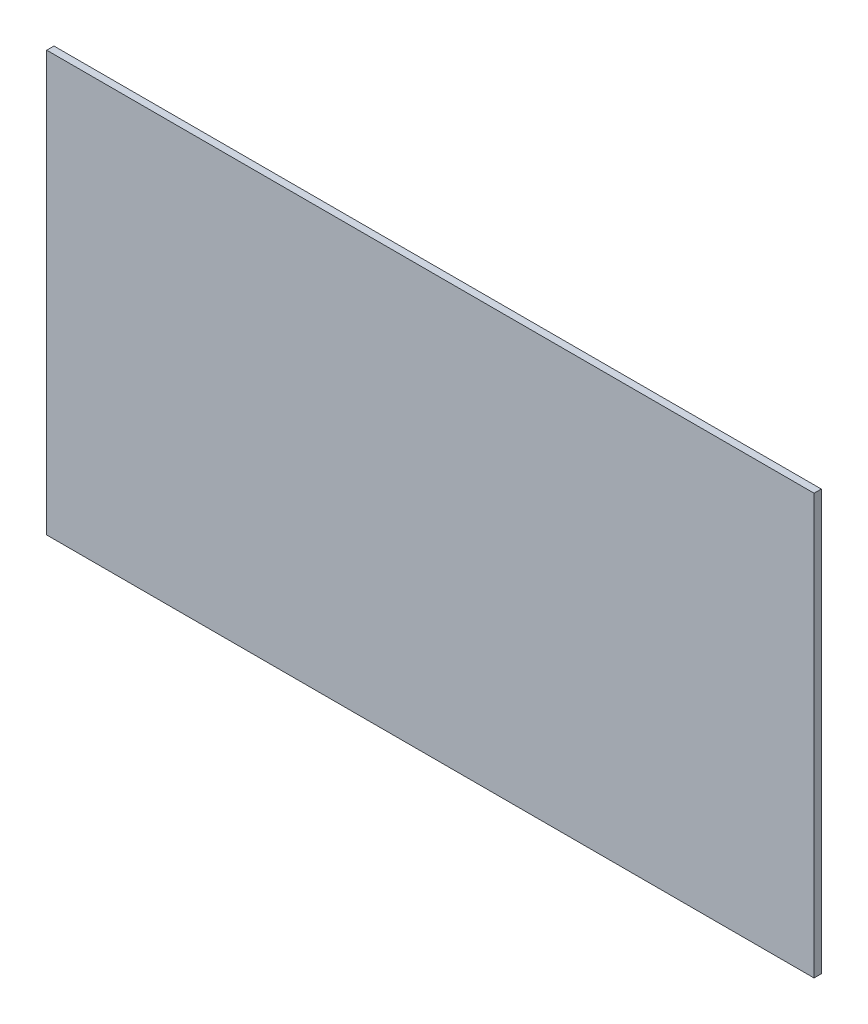
ISO-10303-21;
HEADER;
FILE_DESCRIPTION(('STEP AP214'),'2;1');
FILE_NAME('part.step','',(''),(''),'','','');
FILE_SCHEMA(('AUTOMOTIVE_DESIGN { 1 0 10303 214 1 1 1 1 }'));
ENDSEC;
DATA;
#1=APPLICATION_CONTEXT('core data for automotive mechanical design processes');
#2=APPLICATION_PROTOCOL_DEFINITION('international standard','automotive_design',2000,#1);
#3=PRODUCT_CONTEXT('',#1,'mechanical');
#4=PRODUCT('Part','Part','',(#3));
#5=PRODUCT_RELATED_PRODUCT_CATEGORY('part','',(#4));
#6=PRODUCT_DEFINITION_FORMATION('','',#4);
#7=PRODUCT_DEFINITION_CONTEXT('part definition',#1,'design');
#8=PRODUCT_DEFINITION('design','',#6,#7);
#9=PRODUCT_DEFINITION_SHAPE('','',#8);
#10=(LENGTH_UNIT() NAMED_UNIT(*) SI_UNIT(.MILLI.,.METRE.));
#11=(NAMED_UNIT(*) PLANE_ANGLE_UNIT() SI_UNIT($,.RADIAN.));
#12=(NAMED_UNIT(*) SI_UNIT($,.STERADIAN.) SOLID_ANGLE_UNIT());
#13=UNCERTAINTY_MEASURE_WITH_UNIT(LENGTH_MEASURE(1.E-05),#10,'distance_accuracy_value','');
#14=(GEOMETRIC_REPRESENTATION_CONTEXT(3) GLOBAL_UNCERTAINTY_ASSIGNED_CONTEXT((#13)) GLOBAL_UNIT_ASSIGNED_CONTEXT((#10,
#11,#12)) REPRESENTATION_CONTEXT('',''));
#15=CARTESIAN_POINT('',(0.,0.,0.));
#16=DIRECTION('',(0.,0.,1.));
#17=DIRECTION('',(1.,0.,0.));
#18=AXIS2_PLACEMENT_3D('',#15,#16,#17);
#19=CARTESIAN_POINT('',(-101.204742776555,-23.5514322420355,0.127000000000141));
#20=DIRECTION('',(0.,1.,0.));
#21=DIRECTION('',(0.,0.,1.));
#22=AXIS2_PLACEMENT_3D('',#19,#20,#21);
#23=PLANE('',#22);
#24=DIRECTION('',(1.,0.,0.));
#25=VECTOR('',#24,1.);
#26=CARTESIAN_POINT('',(-101.204742776555,-23.5514322420355,1.38777878078145E-13));
#27=LINE('',#26,#25);
#28=CARTESIAN_POINT('',(-101.204742776555,-23.5514322420355,1.38777878078145E-13));
#29=VERTEX_POINT('',#28);
#30=CARTESIAN_POINT('',(-87.7427427765544,-23.5514322420355,0.));
#31=VERTEX_POINT('',#30);
#32=EDGE_CURVE('E95',#29,#31,#27,.T.);
#33=ORIENTED_EDGE('',*,*,#32,.T.);
#34=DIRECTION('',(0.,0.,-1.));
#35=VECTOR('',#34,1.);
#36=CARTESIAN_POINT('',(-87.7427427765544,-23.5514322420355,0.127000000000002));
#37=LINE('',#36,#35);
#38=CARTESIAN_POINT('',(-87.7427427765544,-23.5514322420355,0.127000000000002));
#39=VERTEX_POINT('',#38);
#40=EDGE_CURVE('E11',#39,#31,#37,.T.);
#41=ORIENTED_EDGE('',*,*,#40,.F.);
#42=DIRECTION('',(1.,0.,0.));
#43=VECTOR('',#42,1.);
#44=CARTESIAN_POINT('',(-101.204742776555,-23.5514322420355,0.127000000000141));
#45=LINE('',#44,#43);
#46=CARTESIAN_POINT('',(-101.204742776555,-23.5514322420355,0.127000000000141));
#47=VERTEX_POINT('',#46);
#48=EDGE_CURVE('E83',#47,#39,#45,.T.);
#49=ORIENTED_EDGE('',*,*,#48,.F.);
#50=DIRECTION('',(0.,0.,-1.));
#51=VECTOR('',#50,1.);
#52=CARTESIAN_POINT('',(-101.204742776555,-23.5514322420355,0.127000000000141));
#53=LINE('',#52,#51);
#54=EDGE_CURVE('E91',#47,#29,#53,.T.);
#55=ORIENTED_EDGE('',*,*,#54,.T.);
#56=EDGE_LOOP('',(#33,#41,#49,#55));
#57=FACE_BOUND('',#56,.T.);
#58=ADVANCED_FACE('F32',(#57),#23,.F.);
#59=CARTESIAN_POINT('',(-87.7427427765544,-23.5514322420355,0.127000000000002));
#60=DIRECTION('',(-1.,0.,0.));
#61=DIRECTION('',(0.,0.,1.));
#62=AXIS2_PLACEMENT_3D('',#59,#60,#61);
#63=PLANE('',#62);
#64=DIRECTION('',(0.,1.,0.));
#65=VECTOR('',#64,1.);
#66=CARTESIAN_POINT('',(-87.7427427765544,-23.5514322420355,0.));
#67=LINE('',#66,#65);
#68=CARTESIAN_POINT('',(-87.7427427765546,-16.1854322420356,0.));
#69=VERTEX_POINT('',#68);
#70=EDGE_CURVE('E87',#31,#69,#67,.T.);
#71=ORIENTED_EDGE('',*,*,#70,.T.);
#72=DIRECTION('',(0.,0.,-1.));
#73=VECTOR('',#72,1.);
#74=CARTESIAN_POINT('',(-87.7427427765546,-16.1854322420356,0.127000000000017));
#75=LINE('',#74,#73);
#76=CARTESIAN_POINT('',(-87.7427427765546,-16.1854322420356,0.127000000000017));
#77=VERTEX_POINT('',#76);
#78=EDGE_CURVE('E40',#77,#69,#75,.T.);
#79=ORIENTED_EDGE('',*,*,#78,.F.);
#80=DIRECTION('',(0.,1.,0.));
#81=VECTOR('',#80,1.);
#82=CARTESIAN_POINT('',(-87.7427427765544,-23.5514322420355,0.127000000000002));
#83=LINE('',#82,#81);
#84=EDGE_CURVE('E78',#39,#77,#83,.T.);
#85=ORIENTED_EDGE('',*,*,#84,.F.);
#86=ORIENTED_EDGE('',*,*,#40,.T.);
#87=EDGE_LOOP('',(#71,#79,#85,#86));
#88=FACE_BOUND('',#87,.T.);
#89=ADVANCED_FACE('F86',(#88),#63,.F.);
#90=CARTESIAN_POINT('',(-87.7427427765546,-16.1854322420356,0.127000000000017));
#91=DIRECTION('',(0.,-1.,0.));
#92=DIRECTION('',(0.,0.,-1.));
#93=AXIS2_PLACEMENT_3D('',#90,#91,#92);
#94=PLANE('',#93);
#95=DIRECTION('',(-1.,0.,0.));
#96=VECTOR('',#95,1.);
#97=CARTESIAN_POINT('',(-87.7427427765546,-16.1854322420356,0.));
#98=LINE('',#97,#96);
#99=CARTESIAN_POINT('',(-101.204742776554,-16.1854322420356,0.));
#100=VERTEX_POINT('',#99);
#101=EDGE_CURVE('E65',#69,#100,#98,.T.);
#102=ORIENTED_EDGE('',*,*,#101,.T.);
#103=DIRECTION('',(0.,0.,-1.));
#104=VECTOR('',#103,1.);
#105=CARTESIAN_POINT('',(-101.204742776554,-16.1854322420356,0.1270000000001));
#106=LINE('',#105,#104);
#107=CARTESIAN_POINT('',(-101.204742776554,-16.1854322420356,0.1270000000001));
#108=VERTEX_POINT('',#107);
#109=EDGE_CURVE('E88',#108,#100,#106,.T.);
#110=ORIENTED_EDGE('',*,*,#109,.F.);
#111=DIRECTION('',(-1.,0.,0.));
#112=VECTOR('',#111,1.);
#113=CARTESIAN_POINT('',(-87.7427427765546,-16.1854322420356,0.127000000000017));
#114=LINE('',#113,#112);
#115=EDGE_CURVE('E81',#77,#108,#114,.T.);
#116=ORIENTED_EDGE('',*,*,#115,.F.);
#117=ORIENTED_EDGE('',*,*,#78,.T.);
#118=EDGE_LOOP('',(#102,#110,#116,#117));
#119=FACE_BOUND('',#118,.T.);
#120=ADVANCED_FACE('F89',(#119),#94,.F.);
#121=CARTESIAN_POINT('',(-101.204742776554,-16.1854322420356,0.1270000000001));
#122=DIRECTION('',(1.,0.,0.));
#123=DIRECTION('',(0.,0.,-1.));
#124=AXIS2_PLACEMENT_3D('',#121,#122,#123);
#125=PLANE('',#124);
#126=DIRECTION('',(0.,-1.,0.));
#127=VECTOR('',#126,1.);
#128=CARTESIAN_POINT('',(-101.204742776554,-16.1854322420356,0.));
#129=LINE('',#128,#127);
#130=EDGE_CURVE('E71',#100,#29,#129,.T.);
#131=ORIENTED_EDGE('',*,*,#130,.T.);
#132=ORIENTED_EDGE('',*,*,#54,.F.);
#133=DIRECTION('',(0.,-1.,0.));
#134=VECTOR('',#133,1.);
#135=CARTESIAN_POINT('',(-101.204742776554,-16.1854322420356,0.1270000000001));
#136=LINE('',#135,#134);
#137=EDGE_CURVE('E48',#108,#47,#136,.T.);
#138=ORIENTED_EDGE('',*,*,#137,.F.);
#139=ORIENTED_EDGE('',*,*,#109,.T.);
#140=EDGE_LOOP('',(#131,#132,#138,#139));
#141=FACE_BOUND('',#140,.T.);
#142=ADVANCED_FACE('F102',(#141),#125,.F.);
#143=CARTESIAN_POINT('',(0.,0.,0.127000000000002));
#144=DIRECTION('',(0.,0.,1.));
#145=DIRECTION('',(1.,0.,0.));
#146=AXIS2_PLACEMENT_3D('',#143,#144,#145);
#147=PLANE('',#146);
#148=ORIENTED_EDGE('',*,*,#48,.T.);
#149=ORIENTED_EDGE('',*,*,#84,.T.);
#150=ORIENTED_EDGE('',*,*,#115,.T.);
#151=ORIENTED_EDGE('',*,*,#137,.T.);
#152=EDGE_LOOP('',(#148,#149,#150,#151));
#153=FACE_BOUND('',#152,.T.);
#154=ADVANCED_FACE('F79',(#153),#147,.T.);
#155=CARTESIAN_POINT('',(0.,0.,0.));
#156=DIRECTION('',(0.,0.,1.));
#157=DIRECTION('',(1.,0.,0.));
#158=AXIS2_PLACEMENT_3D('',#155,#156,#157);
#159=PLANE('',#158);
#160=ORIENTED_EDGE('',*,*,#32,.F.);
#161=ORIENTED_EDGE('',*,*,#130,.F.);
#162=ORIENTED_EDGE('',*,*,#101,.F.);
#163=ORIENTED_EDGE('',*,*,#70,.F.);
#164=EDGE_LOOP('',(#160,#161,#162,#163));
#165=FACE_BOUND('',#164,.T.);
#166=ADVANCED_FACE('F105',(#165),#159,.F.);
#167=CLOSED_SHELL('',(#58,#89,#120,#142,#154,#166));
#168=MANIFOLD_SOLID_BREP('B2',#167);
#169=ADVANCED_BREP_SHAPE_REPRESENTATION('',(#18,#168),#14);
#170=SHAPE_DEFINITION_REPRESENTATION(#9,#169);
ENDSEC;
END-ISO-10303-21;
